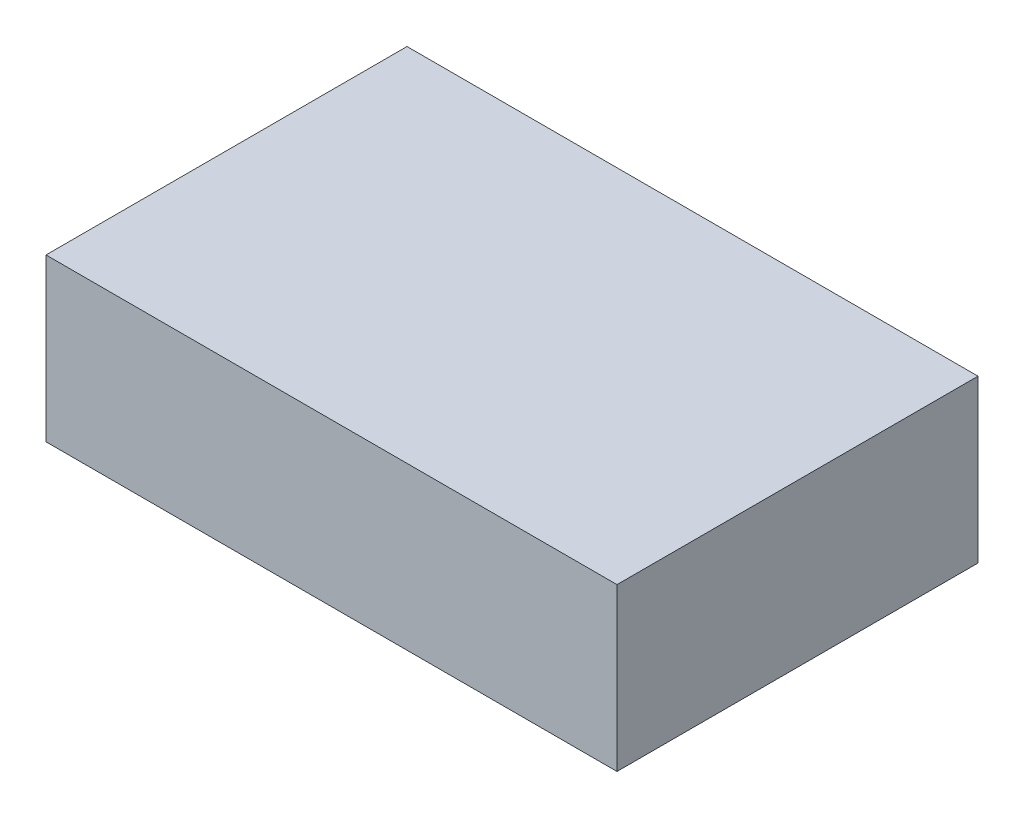
ISO-10303-21;
HEADER;
FILE_DESCRIPTION(('STEP AP214'),'2;1');
FILE_NAME('part.step','',(''),(''),'','','');
FILE_SCHEMA(('AUTOMOTIVE_DESIGN { 1 0 10303 214 1 1 1 1 }'));
ENDSEC;
DATA;
#1=APPLICATION_CONTEXT('core data for automotive mechanical design processes');
#2=APPLICATION_PROTOCOL_DEFINITION('international standard','automotive_design',2000,#1);
#3=PRODUCT_CONTEXT('',#1,'mechanical');
#4=PRODUCT('Part','Part','',(#3));
#5=PRODUCT_RELATED_PRODUCT_CATEGORY('part','',(#4));
#6=PRODUCT_DEFINITION_FORMATION('','',#4);
#7=PRODUCT_DEFINITION_CONTEXT('part definition',#1,'design');
#8=PRODUCT_DEFINITION('design','',#6,#7);
#9=PRODUCT_DEFINITION_SHAPE('','',#8);
#10=(LENGTH_UNIT() NAMED_UNIT(*) SI_UNIT(.MILLI.,.METRE.));
#11=(NAMED_UNIT(*) PLANE_ANGLE_UNIT() SI_UNIT($,.RADIAN.));
#12=(NAMED_UNIT(*) SI_UNIT($,.STERADIAN.) SOLID_ANGLE_UNIT());
#13=UNCERTAINTY_MEASURE_WITH_UNIT(LENGTH_MEASURE(1.E-05),#10,'distance_accuracy_value','');
#14=(GEOMETRIC_REPRESENTATION_CONTEXT(3) GLOBAL_UNCERTAINTY_ASSIGNED_CONTEXT((#13)) GLOBAL_UNIT_ASSIGNED_CONTEXT((#10,
#11,#12)) REPRESENTATION_CONTEXT('',''));
#15=CARTESIAN_POINT('',(0.,0.,0.));
#16=DIRECTION('',(0.,0.,1.));
#17=DIRECTION('',(1.,0.,0.));
#18=AXIS2_PLACEMENT_3D('',#15,#16,#17);
#19=CARTESIAN_POINT('',(-0.47448978,0.13449046,0.));
#20=DIRECTION('',(-2.67655206245712E-06,0.999999999996418,0.));
#21=DIRECTION('',(0.999999999996418,2.67655206245712E-06,0.));
#22=AXIS2_PLACEMENT_3D('',#19,#20,#21);
#23=PLANE('',#22);
#24=DIRECTION('',(0.,0.,1.));
#25=VECTOR('',#24,1.);
#26=CARTESIAN_POINT('',(-0.47448978,0.13449046,0.));
#27=LINE('',#26,#25);
#28=CARTESIAN_POINT('',(-0.47448978,0.13449046,0.));
#29=VERTEX_POINT('',#28);
#30=CARTESIAN_POINT('',(-0.47448978,0.13449046,0.5999988));
#31=VERTEX_POINT('',#30);
#32=EDGE_CURVE('E11',#29,#31,#27,.T.);
#33=ORIENTED_EDGE('',*,*,#32,.T.);
#34=DIRECTION('',(0.999999999996418,2.67655206245712E-06,0.));
#35=VECTOR('',#34,1.);
#36=CARTESIAN_POINT('',(-0.47448978,0.13449046,0.5999988));
#37=LINE('',#36,#35);
#38=CARTESIAN_POINT('',(0.47449232,0.134493,0.5999988));
#39=VERTEX_POINT('',#38);
#40=EDGE_CURVE('E24',#31,#39,#37,.T.);
#41=ORIENTED_EDGE('',*,*,#40,.T.);
#42=DIRECTION('',(0.,0.,1.));
#43=VECTOR('',#42,1.);
#44=CARTESIAN_POINT('',(0.47449232,0.134493,0.));
#45=LINE('',#44,#43);
#46=CARTESIAN_POINT('',(0.47449232,0.134493,0.));
#47=VERTEX_POINT('',#46);
#48=EDGE_CURVE('E85',#47,#39,#45,.T.);
#49=ORIENTED_EDGE('',*,*,#48,.F.);
#50=DIRECTION('',(0.999999999996418,2.67655206245712E-06,0.));
#51=VECTOR('',#50,1.);
#52=CARTESIAN_POINT('',(-0.47448978,0.13449046,0.));
#53=LINE('',#52,#51);
#54=EDGE_CURVE('E83',#29,#47,#53,.T.);
#55=ORIENTED_EDGE('',*,*,#54,.F.);
#56=EDGE_LOOP('',(#33,#41,#49,#55));
#57=FACE_BOUND('',#56,.T.);
#58=ADVANCED_FACE('F17',(#57),#23,.T.);
#59=CARTESIAN_POINT('',(0.47449232,0.134493,0.));
#60=DIRECTION('',(1.,0.,0.));
#61=DIRECTION('',(0.,-1.,0.));
#62=AXIS2_PLACEMENT_3D('',#59,#60,#61);
#63=PLANE('',#62);
#64=ORIENTED_EDGE('',*,*,#48,.T.);
#65=DIRECTION('',(0.,-1.,0.));
#66=VECTOR('',#65,1.);
#67=CARTESIAN_POINT('',(0.47449232,0.134493,0.5999988));
#68=LINE('',#67,#66);
#69=CARTESIAN_POINT('',(0.47449232,-0.13449046,0.5999988));
#70=VERTEX_POINT('',#69);
#71=EDGE_CURVE('E81',#39,#70,#68,.T.);
#72=ORIENTED_EDGE('',*,*,#71,.T.);
#73=DIRECTION('',(0.,0.,1.));
#74=VECTOR('',#73,1.);
#75=CARTESIAN_POINT('',(0.47449232,-0.13449046,0.));
#76=LINE('',#75,#74);
#77=CARTESIAN_POINT('',(0.47449232,-0.13449046,0.));
#78=VERTEX_POINT('',#77);
#79=EDGE_CURVE('E79',#78,#70,#76,.T.);
#80=ORIENTED_EDGE('',*,*,#79,.F.);
#81=DIRECTION('',(0.,-1.,0.));
#82=VECTOR('',#81,1.);
#83=CARTESIAN_POINT('',(0.47449232,0.134493,0.));
#84=LINE('',#83,#82);
#85=EDGE_CURVE('E70',#47,#78,#84,.T.);
#86=ORIENTED_EDGE('',*,*,#85,.F.);
#87=EDGE_LOOP('',(#64,#72,#80,#86));
#88=FACE_BOUND('',#87,.T.);
#89=ADVANCED_FACE('F90',(#88),#63,.T.);
#90=CARTESIAN_POINT('',(0.47449232,-0.13449046,0.));
#91=DIRECTION('',(0.,-1.,0.));
#92=DIRECTION('',(-1.,0.,0.));
#93=AXIS2_PLACEMENT_3D('',#90,#91,#92);
#94=PLANE('',#93);
#95=ORIENTED_EDGE('',*,*,#79,.T.);
#96=DIRECTION('',(-1.,0.,0.));
#97=VECTOR('',#96,1.);
#98=CARTESIAN_POINT('',(0.47449232,-0.13449046,0.5999988));
#99=LINE('',#98,#97);
#100=CARTESIAN_POINT('',(-0.47448724,-0.13449046,0.5999988));
#101=VERTEX_POINT('',#100);
#102=EDGE_CURVE('E60',#70,#101,#99,.T.);
#103=ORIENTED_EDGE('',*,*,#102,.T.);
#104=DIRECTION('',(0.,0.,1.));
#105=VECTOR('',#104,1.);
#106=CARTESIAN_POINT('',(-0.47448724,-0.13449046,0.));
#107=LINE('',#106,#105);
#108=CARTESIAN_POINT('',(-0.47448724,-0.13449046,0.));
#109=VERTEX_POINT('',#108);
#110=EDGE_CURVE('E54',#109,#101,#107,.T.);
#111=ORIENTED_EDGE('',*,*,#110,.F.);
#112=DIRECTION('',(-1.,0.,0.));
#113=VECTOR('',#112,1.);
#114=CARTESIAN_POINT('',(0.47449232,-0.13449046,0.));
#115=LINE('',#114,#113);
#116=EDGE_CURVE('E58',#78,#109,#115,.T.);
#117=ORIENTED_EDGE('',*,*,#116,.F.);
#118=EDGE_LOOP('',(#95,#103,#111,#117));
#119=FACE_BOUND('',#118,.T.);
#120=ADVANCED_FACE('F57',(#119),#94,.T.);
#121=CARTESIAN_POINT('',(-0.47448724,-0.13449046,0.));
#122=DIRECTION('',(-0.999999999955414,-9.44304896007291E-06,0.));
#123=DIRECTION('',(-9.44304896007291E-06,0.999999999955414,0.));
#124=AXIS2_PLACEMENT_3D('',#121,#122,#123);
#125=PLANE('',#124);
#126=ORIENTED_EDGE('',*,*,#110,.T.);
#127=DIRECTION('',(-9.44304896007291E-06,0.999999999955414,0.));
#128=VECTOR('',#127,1.);
#129=CARTESIAN_POINT('',(-0.47448724,-0.13449046,0.5999988));
#130=LINE('',#129,#128);
#131=EDGE_CURVE('E71',#101,#31,#130,.T.);
#132=ORIENTED_EDGE('',*,*,#131,.T.);
#133=ORIENTED_EDGE('',*,*,#32,.F.);
#134=DIRECTION('',(-9.44304896007291E-06,0.999999999955414,0.));
#135=VECTOR('',#134,1.);
#136=CARTESIAN_POINT('',(-0.47448724,-0.13449046,0.));
#137=LINE('',#136,#135);
#138=EDGE_CURVE('E68',#109,#29,#137,.T.);
#139=ORIENTED_EDGE('',*,*,#138,.F.);
#140=EDGE_LOOP('',(#126,#132,#133,#139));
#141=FACE_BOUND('',#140,.T.);
#142=ADVANCED_FACE('F73',(#141),#125,.T.);
#143=CARTESIAN_POINT('',(-0.47448978,0.13449046,0.));
#144=DIRECTION('',(0.,0.,1.));
#145=DIRECTION('',(1.,0.,0.));
#146=AXIS2_PLACEMENT_3D('',#143,#144,#145);
#147=PLANE('',#146);
#148=ORIENTED_EDGE('',*,*,#54,.T.);
#149=ORIENTED_EDGE('',*,*,#85,.T.);
#150=ORIENTED_EDGE('',*,*,#116,.T.);
#151=ORIENTED_EDGE('',*,*,#138,.T.);
#152=EDGE_LOOP('',(#148,#149,#150,#151));
#153=FACE_BOUND('',#152,.T.);
#154=ADVANCED_FACE('F67',(#153),#147,.F.);
#155=CARTESIAN_POINT('',(-0.47448978,0.13449046,0.5999988));
#156=DIRECTION('',(0.,0.,1.));
#157=DIRECTION('',(1.,0.,0.));
#158=AXIS2_PLACEMENT_3D('',#155,#156,#157);
#159=PLANE('',#158);
#160=ORIENTED_EDGE('',*,*,#131,.F.);
#161=ORIENTED_EDGE('',*,*,#102,.F.);
#162=ORIENTED_EDGE('',*,*,#71,.F.);
#163=ORIENTED_EDGE('',*,*,#40,.F.);
#164=EDGE_LOOP('',(#160,#161,#162,#163));
#165=FACE_BOUND('',#164,.T.);
#166=ADVANCED_FACE('F91',(#165),#159,.T.);
#167=CLOSED_SHELL('',(#58,#89,#120,#142,#154,#166));
#168=MANIFOLD_SOLID_BREP('B1',#167);
#169=ADVANCED_BREP_SHAPE_REPRESENTATION('',(#18,#168),#14);
#170=SHAPE_DEFINITION_REPRESENTATION(#9,#169);
ENDSEC;
END-ISO-10303-21;
